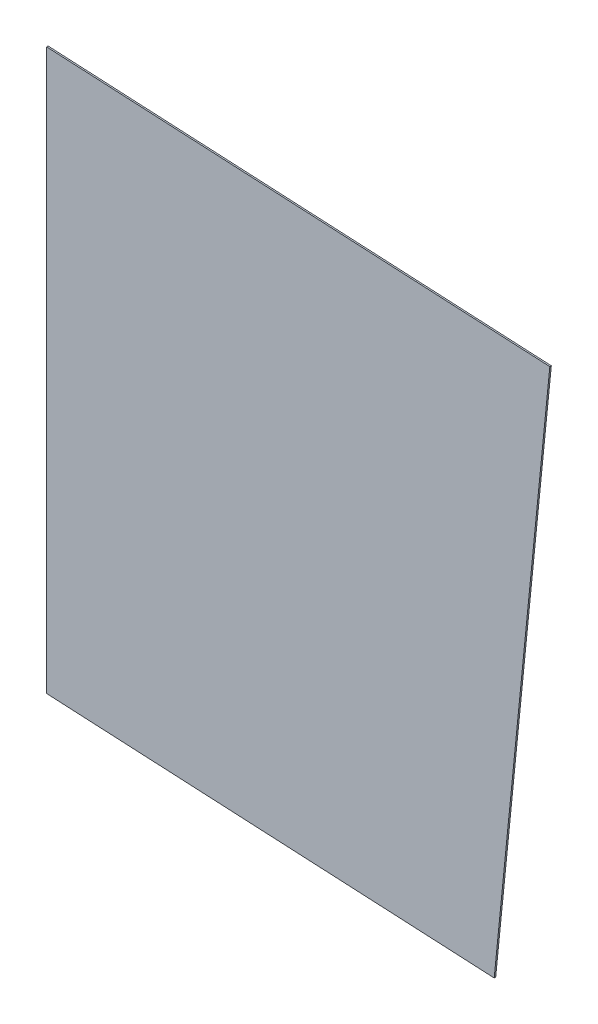
ISO-10303-21;
HEADER;
FILE_DESCRIPTION(('STEP AP214'),'2;1');
FILE_NAME('part.step','',(''),(''),'','','');
FILE_SCHEMA(('AUTOMOTIVE_DESIGN { 1 0 10303 214 1 1 1 1 }'));
ENDSEC;
DATA;
#1=APPLICATION_CONTEXT('core data for automotive mechanical design processes');
#2=APPLICATION_PROTOCOL_DEFINITION('international standard','automotive_design',2000,#1);
#3=PRODUCT_CONTEXT('',#1,'mechanical');
#4=PRODUCT('Part','Part','',(#3));
#5=PRODUCT_RELATED_PRODUCT_CATEGORY('part','',(#4));
#6=PRODUCT_DEFINITION_FORMATION('','',#4);
#7=PRODUCT_DEFINITION_CONTEXT('part definition',#1,'design');
#8=PRODUCT_DEFINITION('design','',#6,#7);
#9=PRODUCT_DEFINITION_SHAPE('','',#8);
#10=(LENGTH_UNIT() NAMED_UNIT(*) SI_UNIT(.MILLI.,.METRE.));
#11=(NAMED_UNIT(*) PLANE_ANGLE_UNIT() SI_UNIT($,.RADIAN.));
#12=(NAMED_UNIT(*) SI_UNIT($,.STERADIAN.) SOLID_ANGLE_UNIT());
#13=UNCERTAINTY_MEASURE_WITH_UNIT(LENGTH_MEASURE(1.E-05),#10,'distance_accuracy_value','');
#14=(GEOMETRIC_REPRESENTATION_CONTEXT(3) GLOBAL_UNCERTAINTY_ASSIGNED_CONTEXT((#13)) GLOBAL_UNIT_ASSIGNED_CONTEXT((#10,
#11,#12)) REPRESENTATION_CONTEXT('',''));
#15=CARTESIAN_POINT('',(0.,0.,0.));
#16=DIRECTION('',(0.,0.,1.));
#17=DIRECTION('',(1.,0.,0.));
#18=AXIS2_PLACEMENT_3D('',#15,#16,#17);
#19=CARTESIAN_POINT('',(-7.25428510589658,-119.226864694282,-0.127));
#20=DIRECTION('',(0.,0.,1.));
#21=DIRECTION('',(0.998732157892518,-0.0503396145332239,0.));
#22=AXIS2_PLACEMENT_3D('',#19,#20,#21);
#23=PLANE('',#22);
#24=DIRECTION('',(-0.0993197497435501,-0.995055569961235,0.));
#25=VECTOR('',#24,1.);
#26=CARTESIAN_POINT('',(88.9127060620656,-69.6012044588252,-0.127));
#27=LINE('',#26,#25);
#28=CARTESIAN_POINT('',(83.7108859572727,-121.716721086313,-0.127));
#29=VERTEX_POINT('',#28);
#30=CARTESIAN_POINT('',(94.1145261668413,-17.4856878313439,-0.127));
#31=VERTEX_POINT('',#30);
#32=EDGE_CURVE('E87',#29,#31,#27,.F.);
#33=ORIENTED_EDGE('',*,*,#32,.T.);
#34=DIRECTION('',(0.998732157892525,-0.0503396145330951,0.));
#35=VECTOR('',#34,1.);
#36=CARTESIAN_POINT('',(47.0572630834234,-15.1138362133885,-0.127));
#37=LINE('',#36,#35);
#38=CARTESIAN_POINT('',(0.,-12.7419845954316,-0.127));
#39=VERTEX_POINT('',#38);
#40=EDGE_CURVE('E67',#31,#39,#37,.F.);
#41=ORIENTED_EDGE('',*,*,#40,.T.);
#42=DIRECTION('',(0.,1.,0.));
#43=VECTOR('',#42,1.);
#44=CARTESIAN_POINT('',(0.,-65.1196912574309,-0.127));
#45=LINE('',#44,#43);
#46=CARTESIAN_POINT('',(2.50752245573374E-13,-117.497397919436,-0.127));
#47=VERTEX_POINT('',#46);
#48=EDGE_CURVE('E54',#39,#47,#45,.F.);
#49=ORIENTED_EDGE('',*,*,#48,.T.);
#50=DIRECTION('',(-0.998732157892525,0.050339614533093,0.));
#51=VECTOR('',#50,1.);
#52=CARTESIAN_POINT('',(41.8554429786352,-119.607059502865,-0.127));
#53=LINE('',#52,#51);
#54=EDGE_CURVE('E65',#47,#29,#53,.F.);
#55=ORIENTED_EDGE('',*,*,#54,.T.);
#56=EDGE_LOOP('',(#33,#41,#49,#55));
#57=FACE_BOUND('',#56,.T.);
#58=ADVANCED_FACE('F17',(#57),#23,.T.);
#59=CARTESIAN_POINT('',(0.,-10.646876328953,-0.575365851820986));
#60=DIRECTION('',(-1.,0.,0.));
#61=DIRECTION('',(0.,-1.,0.));
#62=AXIS2_PLACEMENT_3D('',#59,#60,#61);
#63=PLANE('',#62);
#64=ORIENTED_EDGE('',*,*,#48,.F.);
#65=DIRECTION('',(0.,0.,1.));
#66=VECTOR('',#65,1.);
#67=CARTESIAN_POINT('',(0.,-12.7419845954326,-0.266699999999975));
#68=LINE('',#67,#66);
#69=CARTESIAN_POINT('',(0.,-12.741984595432,-0.4064));
#70=VERTEX_POINT('',#69);
#71=EDGE_CURVE('E79',#39,#70,#68,.F.);
#72=ORIENTED_EDGE('',*,*,#71,.T.);
#73=DIRECTION('',(0.,-1.,0.));
#74=VECTOR('',#73,1.);
#75=CARTESIAN_POINT('',(0.,-10.646876328953,-0.4064));
#76=LINE('',#75,#74);
#77=CARTESIAN_POINT('',(2.53594888144359E-13,-117.497397919431,-0.4064));
#78=VERTEX_POINT('',#77);
#79=EDGE_CURVE('E21',#70,#78,#76,.T.);
#80=ORIENTED_EDGE('',*,*,#79,.T.);
#81=DIRECTION('',(0.,0.,-1.));
#82=VECTOR('',#81,1.);
#83=CARTESIAN_POINT('',(1.00744065867353E-12,-117.497397919421,-0.266699999999975));
#84=LINE('',#83,#82);
#85=EDGE_CURVE('E68',#78,#47,#84,.F.);
#86=ORIENTED_EDGE('',*,*,#85,.T.);
#87=EDGE_LOOP('',(#64,#72,#80,#86));
#88=FACE_BOUND('',#87,.T.);
#89=ADVANCED_FACE('F76',(#88),#63,.T.);
#90=CARTESIAN_POINT('',(-1.67421771914537,-117.413011456083,-0.575365851820986));
#91=DIRECTION('',(-0.050339614533093,-0.998732157892525,0.));
#92=DIRECTION('',(0.998732157892525,-0.050339614533093,0.));
#93=AXIS2_PLACEMENT_3D('',#90,#91,#92);
#94=PLANE('',#93);
#95=ORIENTED_EDGE('',*,*,#54,.F.);
#96=ORIENTED_EDGE('',*,*,#85,.F.);
#97=DIRECTION('',(0.998732157892518,-0.0503396145332214,0.));
#98=VECTOR('',#97,1.);
#99=CARTESIAN_POINT('',(41.7906017279729,-119.60379127573,-0.4064));
#100=LINE('',#99,#98);
#101=CARTESIAN_POINT('',(83.7108859572838,-121.716721086329,-0.4064));
#102=VERTEX_POINT('',#101);
#103=EDGE_CURVE('E81',#78,#102,#100,.T.);
#104=ORIENTED_EDGE('',*,*,#103,.T.);
#105=DIRECTION('',(0.,0.,-1.));
#106=VECTOR('',#105,1.);
#107=CARTESIAN_POINT('',(83.710885957285,-121.716721086316,-0.266699999999975));
#108=LINE('',#107,#106);
#109=EDGE_CURVE('E74',#102,#29,#108,.F.);
#110=ORIENTED_EDGE('',*,*,#109,.T.);
#111=EDGE_LOOP('',(#95,#96,#104,#110));
#112=FACE_BOUND('',#111,.T.);
#113=ADVANCED_FACE('F72',(#112),#94,.T.);
#114=CARTESIAN_POINT('',(83.5028131530948,-123.801341751406,-0.575365851820986));
#115=DIRECTION('',(0.995055569961235,-0.0993197497435501,0.));
#116=DIRECTION('',(0.0993197497435501,0.995055569961235,0.));
#117=AXIS2_PLACEMENT_3D('',#114,#115,#116);
#118=PLANE('',#117);
#119=ORIENTED_EDGE('',*,*,#32,.F.);
#120=ORIENTED_EDGE('',*,*,#109,.F.);
#121=DIRECTION('',(0.0993197497435501,0.995055569961235,0.));
#122=VECTOR('',#121,1.);
#123=CARTESIAN_POINT('',(83.5028131530948,-123.801341751406,-0.4064));
#124=LINE('',#123,#122);
#125=CARTESIAN_POINT('',(94.1145261668413,-17.4856878313437,-0.4064));
#126=VERTEX_POINT('',#125);
#127=EDGE_CURVE('E27',#102,#126,#124,.T.);
#128=ORIENTED_EDGE('',*,*,#127,.T.);
#129=DIRECTION('',(0.,0.,-1.));
#130=VECTOR('',#129,1.);
#131=CARTESIAN_POINT('',(94.1145261668374,-17.485687831344,-0.266699999999975));
#132=LINE('',#131,#130);
#133=EDGE_CURVE('E35',#126,#31,#132,.F.);
#134=ORIENTED_EDGE('',*,*,#133,.T.);
#135=EDGE_LOOP('',(#119,#120,#128,#134));
#136=FACE_BOUND('',#135,.T.);
#137=ADVANCED_FACE('F96',(#136),#118,.T.);
#138=CARTESIAN_POINT('',(95.9968166901838,-17.5805618960627,-0.575365851820986));
#139=DIRECTION('',(0.0503396145330952,0.998732157892525,0.));
#140=DIRECTION('',(-0.998732157892525,0.0503396145330952,0.));
#141=AXIS2_PLACEMENT_3D('',#138,#139,#140);
#142=PLANE('',#141);
#143=ORIENTED_EDGE('',*,*,#40,.F.);
#144=ORIENTED_EDGE('',*,*,#133,.F.);
#145=DIRECTION('',(-0.998732157892525,0.0503396145331007,0.));
#146=VECTOR('',#145,1.);
#147=CARTESIAN_POINT('',(47.0572630834206,-15.1138362133875,-0.4064));
#148=LINE('',#147,#146);
#149=EDGE_CURVE('E11',#126,#70,#148,.T.);
#150=ORIENTED_EDGE('',*,*,#149,.T.);
#151=ORIENTED_EDGE('',*,*,#71,.F.);
#152=EDGE_LOOP('',(#143,#144,#150,#151));
#153=FACE_BOUND('',#152,.T.);
#154=ADVANCED_FACE('F90',(#153),#142,.T.);
#155=CARTESIAN_POINT('',(-7.25428510589658,-119.226864694282,-0.4064));
#156=DIRECTION('',(0.,0.,1.));
#157=DIRECTION('',(0.998732157892518,-0.0503396145332239,0.));
#158=AXIS2_PLACEMENT_3D('',#155,#156,#157);
#159=PLANE('',#158);
#160=ORIENTED_EDGE('',*,*,#127,.F.);
#161=ORIENTED_EDGE('',*,*,#103,.F.);
#162=ORIENTED_EDGE('',*,*,#79,.F.);
#163=ORIENTED_EDGE('',*,*,#149,.F.);
#164=EDGE_LOOP('',(#160,#161,#162,#163));
#165=FACE_BOUND('',#164,.T.);
#166=ADVANCED_FACE('F19',(#165),#159,.F.);
#167=CLOSED_SHELL('',(#58,#89,#113,#137,#154,#166));
#168=MANIFOLD_SOLID_BREP('B1',#167);
#169=ADVANCED_BREP_SHAPE_REPRESENTATION('',(#18,#168),#14);
#170=SHAPE_DEFINITION_REPRESENTATION(#9,#169);
ENDSEC;
END-ISO-10303-21;
